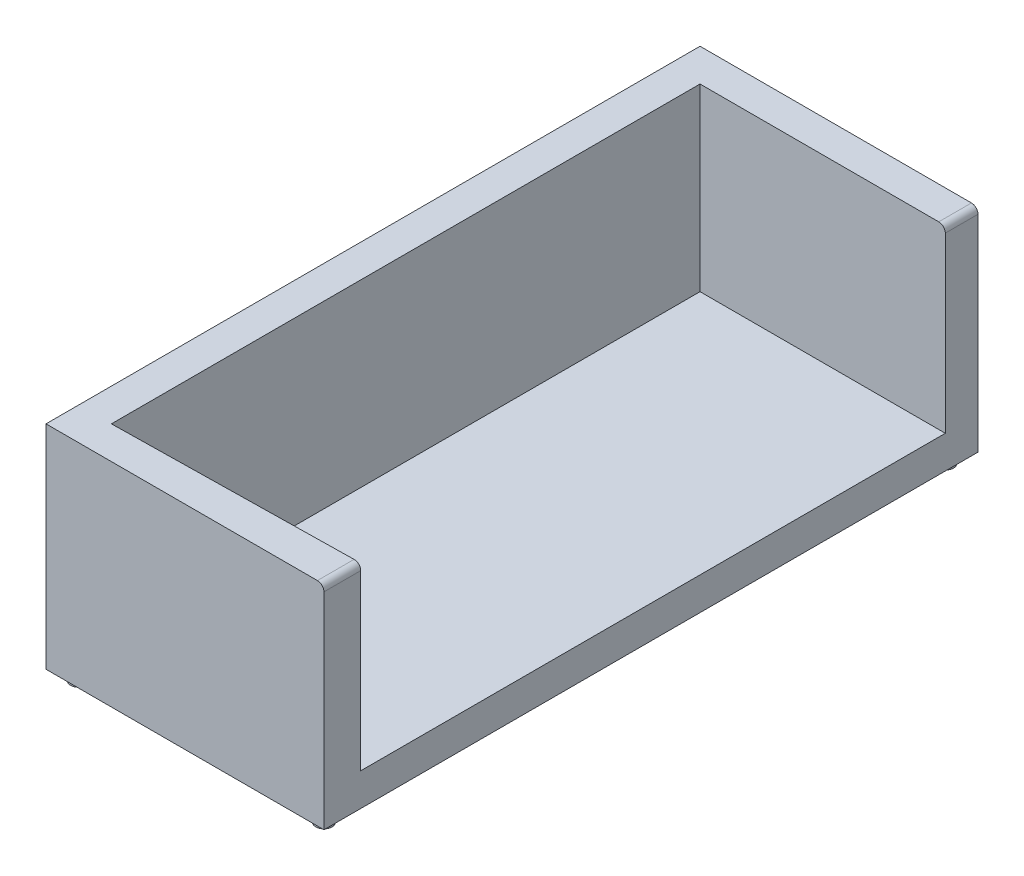
ISO-10303-21;
HEADER;
FILE_DESCRIPTION(('STEP AP214'),'2;1');
FILE_NAME('part.step','',(''),(''),'','','');
FILE_SCHEMA(('AUTOMOTIVE_DESIGN { 1 0 10303 214 1 1 1 1 }'));
ENDSEC;
DATA;
#1=APPLICATION_CONTEXT('core data for automotive mechanical design processes');
#2=APPLICATION_PROTOCOL_DEFINITION('international standard','automotive_design',2000,#1);
#3=PRODUCT_CONTEXT('',#1,'mechanical');
#4=PRODUCT('Part','Part','',(#3));
#5=PRODUCT_RELATED_PRODUCT_CATEGORY('part','',(#4));
#6=PRODUCT_DEFINITION_FORMATION('','',#4);
#7=PRODUCT_DEFINITION_CONTEXT('part definition',#1,'design');
#8=PRODUCT_DEFINITION('design','',#6,#7);
#9=PRODUCT_DEFINITION_SHAPE('','',#8);
#10=(LENGTH_UNIT() NAMED_UNIT(*) SI_UNIT(.MILLI.,.METRE.));
#11=(NAMED_UNIT(*) PLANE_ANGLE_UNIT() SI_UNIT($,.RADIAN.));
#12=(NAMED_UNIT(*) SI_UNIT($,.STERADIAN.) SOLID_ANGLE_UNIT());
#13=UNCERTAINTY_MEASURE_WITH_UNIT(LENGTH_MEASURE(1.E-05),#10,'distance_accuracy_value','');
#14=(GEOMETRIC_REPRESENTATION_CONTEXT(3) GLOBAL_UNCERTAINTY_ASSIGNED_CONTEXT((#13)) GLOBAL_UNIT_ASSIGNED_CONTEXT((#10,
#11,#12)) REPRESENTATION_CONTEXT('',''));
#15=CARTESIAN_POINT('',(0.,0.,0.));
#16=DIRECTION('',(0.,0.,1.));
#17=DIRECTION('',(1.,0.,0.));
#18=AXIS2_PLACEMENT_3D('',#15,#16,#17);
#19=CARTESIAN_POINT('',(405.,250.96506440014,2000.));
#20=DIRECTION('',(0.,0.,-1.));
#21=DIRECTION('',(-1.,0.,0.));
#22=AXIS2_PLACEMENT_3D('',#19,#20,#21);
#23=CYLINDRICAL_SURFACE('',#22,20.);
#24=DIRECTION('',(0.,0.,-1.));
#25=VECTOR('',#24,1.);
#26=CARTESIAN_POINT('',(405.,270.96506440014,2000.));
#27=LINE('',#26,#25);
#28=CARTESIAN_POINT('',(405.,270.96506440014,100.));
#29=VERTEX_POINT('',#28);
#30=CARTESIAN_POINT('',(405.,270.96506440014,0.));
#31=VERTEX_POINT('',#30);
#32=EDGE_CURVE('E121',#29,#31,#27,.T.);
#33=ORIENTED_EDGE('',*,*,#32,.F.);
#34=CARTESIAN_POINT('',(405.,250.96506440014,100.));
#35=DIRECTION('',(0.,0.,-1.));
#36=DIRECTION('',(-1.,0.,0.));
#37=AXIS2_PLACEMENT_3D('',#34,#35,#36);
#38=CIRCLE('',#37,20.);
#39=CARTESIAN_POINT('',(425.,250.96506440014,100.));
#40=VERTEX_POINT('',#39);
#41=EDGE_CURVE('E134',#29,#40,#38,.T.);
#42=ORIENTED_EDGE('',*,*,#41,.T.);
#43=DIRECTION('',(0.,0.,-1.));
#44=VECTOR('',#43,1.);
#45=CARTESIAN_POINT('',(425.,250.96506440014,2000.));
#46=LINE('',#45,#44);
#47=CARTESIAN_POINT('',(425.,250.96506440014,0.));
#48=VERTEX_POINT('',#47);
#49=EDGE_CURVE('E146',#40,#48,#46,.T.);
#50=ORIENTED_EDGE('',*,*,#49,.T.);
#51=CARTESIAN_POINT('',(405.,250.96506440014,0.));
#52=DIRECTION('',(0.,0.,1.));
#53=DIRECTION('',(-1.,0.,0.));
#54=AXIS2_PLACEMENT_3D('',#51,#52,#53);
#55=CIRCLE('',#54,20.);
#56=EDGE_CURVE('E133',#48,#31,#55,.T.);
#57=ORIENTED_EDGE('',*,*,#56,.T.);
#58=EDGE_LOOP('',(#33,#42,#50,#57));
#59=FACE_BOUND('',#58,.T.);
#60=ADVANCED_FACE('F42',(#59),#23,.T.);
#61=CARTESIAN_POINT('',(425.,250.96506440014,2000.));
#62=DIRECTION('',(-1.,0.,0.));
#63=DIRECTION('',(0.,0.,1.));
#64=AXIS2_PLACEMENT_3D('',#61,#62,#63);
#65=PLANE('',#64);
#66=ORIENTED_EDGE('',*,*,#49,.F.);
#67=DIRECTION('',(0.,1.,0.));
#68=VECTOR('',#67,1.);
#69=CARTESIAN_POINT('',(425.,-279.03493559986,100.));
#70=LINE('',#69,#68);
#71=CARTESIAN_POINT('',(425.,-279.03493559986,100.));
#72=VERTEX_POINT('',#71);
#73=EDGE_CURVE('E222',#72,#40,#70,.T.);
#74=ORIENTED_EDGE('',*,*,#73,.F.);
#75=DIRECTION('',(0.,0.,-1.));
#76=VECTOR('',#75,1.);
#77=CARTESIAN_POINT('',(425.,-279.03493559986,1887.57501564121));
#78=LINE('',#77,#76);
#79=CARTESIAN_POINT('',(425.,-279.03493559986,1887.57501564121));
#80=VERTEX_POINT('',#79);
#81=EDGE_CURVE('E218',#80,#72,#78,.T.);
#82=ORIENTED_EDGE('',*,*,#81,.F.);
#83=DIRECTION('',(0.,1.,0.));
#84=VECTOR('',#83,1.);
#85=CARTESIAN_POINT('',(425.,-279.03493559986,1887.57501564121));
#86=LINE('',#85,#84);
#87=CARTESIAN_POINT('',(425.,250.96506440014,1887.57501564121));
#88=VERTEX_POINT('',#87);
#89=EDGE_CURVE('E214',#80,#88,#86,.T.);
#90=ORIENTED_EDGE('',*,*,#89,.T.);
#91=CARTESIAN_POINT('',(425.,250.96506440014,2000.));
#92=VERTEX_POINT('',#91);
#93=EDGE_CURVE('E147',#92,#88,#46,.T.);
#94=ORIENTED_EDGE('',*,*,#93,.F.);
#95=DIRECTION('',(0.,1.,0.));
#96=VECTOR('',#95,1.);
#97=CARTESIAN_POINT('',(425.,250.96506440014,2000.));
#98=LINE('',#97,#96);
#99=CARTESIAN_POINT('',(425.,-379.03493559986,2000.));
#100=VERTEX_POINT('',#99);
#101=EDGE_CURVE('E141',#100,#92,#98,.T.);
#102=ORIENTED_EDGE('',*,*,#101,.F.);
#103=DIRECTION('',(0.,0.,-1.));
#104=VECTOR('',#103,1.);
#105=CARTESIAN_POINT('',(425.,-379.03493559986,2000.));
#106=LINE('',#105,#104);
#107=CARTESIAN_POINT('',(425.,-379.03493559986,0.));
#108=VERTEX_POINT('',#107);
#109=EDGE_CURVE('E126',#100,#108,#106,.T.);
#110=ORIENTED_EDGE('',*,*,#109,.T.);
#111=DIRECTION('',(0.,1.,0.));
#112=VECTOR('',#111,1.);
#113=CARTESIAN_POINT('',(425.,250.96506440014,0.));
#114=LINE('',#113,#112);
#115=EDGE_CURVE('E130',#108,#48,#114,.T.);
#116=ORIENTED_EDGE('',*,*,#115,.T.);
#117=EDGE_LOOP('',(#66,#74,#82,#90,#94,#102,#110,#116));
#118=FACE_BOUND('',#117,.T.);
#119=ADVANCED_FACE('F44',(#118),#65,.F.);
#120=ORIENTED_EDGE('',*,*,#93,.T.);
#121=CARTESIAN_POINT('',(405.,250.96506440014,1887.90634855744));
#122=DIRECTION('',(0.0165643728905062,0.,0.999862801363639));
#123=DIRECTION('',(0.999862801363639,0.,-0.0165643728905062));
#124=AXIS2_PLACEMENT_3D('',#121,#122,#123);
#125=ELLIPSE('',#124,20.0027443492482,20.);
#126=CARTESIAN_POINT('',(405.,270.96506440014,1887.90634855744));
#127=VERTEX_POINT('',#126);
#128=EDGE_CURVE('E206',#88,#127,#125,.T.);
#129=ORIENTED_EDGE('',*,*,#128,.T.);
#130=CARTESIAN_POINT('',(405.,270.96506440014,2000.));
#131=VERTEX_POINT('',#130);
#132=EDGE_CURVE('E144',#131,#127,#27,.T.);
#133=ORIENTED_EDGE('',*,*,#132,.F.);
#134=CARTESIAN_POINT('',(405.,250.96506440014,2000.));
#135=DIRECTION('',(0.,0.,1.));
#136=DIRECTION('',(-1.,0.,0.));
#137=AXIS2_PLACEMENT_3D('',#134,#135,#136);
#138=CIRCLE('',#137,20.);
#139=EDGE_CURVE('E99',#92,#131,#138,.T.);
#140=ORIENTED_EDGE('',*,*,#139,.F.);
#141=EDGE_LOOP('',(#120,#129,#133,#140));
#142=FACE_BOUND('',#141,.T.);
#143=ADVANCED_FACE('F190',(#142),#23,.T.);
#144=CARTESIAN_POINT('',(-425.,270.96506440014,2000.));
#145=DIRECTION('',(0.,-1.,0.));
#146=DIRECTION('',(0.,0.,-1.));
#147=AXIS2_PLACEMENT_3D('',#144,#145,#146);
#148=PLANE('',#147);
#149=DIRECTION('',(0.,0.,1.));
#150=VECTOR('',#149,1.);
#151=CARTESIAN_POINT('',(-325.,270.96506440014,100.));
#152=LINE('',#151,#150);
#153=CARTESIAN_POINT('',(-325.,270.96506440014,100.));
#154=VERTEX_POINT('',#153);
#155=CARTESIAN_POINT('',(-325.,270.96506440014,1900.));
#156=VERTEX_POINT('',#155);
#157=EDGE_CURVE('E57',#154,#156,#152,.T.);
#158=ORIENTED_EDGE('',*,*,#157,.F.);
#159=DIRECTION('',(1.,0.,0.));
#160=VECTOR('',#159,1.);
#161=CARTESIAN_POINT('',(-425.,270.96506440014,100.));
#162=LINE('',#161,#160);
#163=EDGE_CURVE('E149',#154,#29,#162,.T.);
#164=ORIENTED_EDGE('',*,*,#163,.T.);
#165=ORIENTED_EDGE('',*,*,#32,.T.);
#166=DIRECTION('',(-1.,0.,0.));
#167=VECTOR('',#166,1.);
#168=CARTESIAN_POINT('',(-425.,270.96506440014,0.));
#169=LINE('',#168,#167);
#170=CARTESIAN_POINT('',(-425.,270.96506440014,0.));
#171=VERTEX_POINT('',#170);
#172=EDGE_CURVE('E118',#31,#171,#169,.T.);
#173=ORIENTED_EDGE('',*,*,#172,.T.);
#174=DIRECTION('',(0.,0.,-1.));
#175=VECTOR('',#174,1.);
#176=CARTESIAN_POINT('',(-425.,270.96506440014,2000.));
#177=LINE('',#176,#175);
#178=CARTESIAN_POINT('',(-425.,270.96506440014,2000.));
#179=VERTEX_POINT('',#178);
#180=EDGE_CURVE('E115',#179,#171,#177,.T.);
#181=ORIENTED_EDGE('',*,*,#180,.F.);
#182=DIRECTION('',(-1.,0.,0.));
#183=VECTOR('',#182,1.);
#184=CARTESIAN_POINT('',(-425.,270.96506440014,2000.));
#185=LINE('',#184,#183);
#186=EDGE_CURVE('E105',#131,#179,#185,.T.);
#187=ORIENTED_EDGE('',*,*,#186,.F.);
#188=ORIENTED_EDGE('',*,*,#132,.T.);
#189=DIRECTION('',(0.999862801363639,0.,-0.0165643728905062));
#190=VECTOR('',#189,1.);
#191=CARTESIAN_POINT('',(-325.,270.96506440014,1900.));
#192=LINE('',#191,#190);
#193=EDGE_CURVE('E433',#156,#127,#192,.T.);
#194=ORIENTED_EDGE('',*,*,#193,.F.);
#195=EDGE_LOOP('',(#158,#164,#165,#173,#181,#187,#188,#194));
#196=FACE_BOUND('',#195,.T.);
#197=ADVANCED_FACE('F116',(#196),#148,.F.);
#198=CARTESIAN_POINT('',(-425.,270.96506440014,2000.));
#199=DIRECTION('',(1.,0.,0.));
#200=DIRECTION('',(0.,0.,-1.));
#201=AXIS2_PLACEMENT_3D('',#198,#199,#200);
#202=PLANE('',#201);
#203=DIRECTION('',(0.,-1.,0.));
#204=VECTOR('',#203,1.);
#205=CARTESIAN_POINT('',(-425.,270.96506440014,0.));
#206=LINE('',#205,#204);
#207=CARTESIAN_POINT('',(-425.,-379.03493559986,0.));
#208=VERTEX_POINT('',#207);
#209=EDGE_CURVE('E138',#171,#208,#206,.T.);
#210=ORIENTED_EDGE('',*,*,#209,.T.);
#211=DIRECTION('',(0.,0.,-1.));
#212=VECTOR('',#211,1.);
#213=CARTESIAN_POINT('',(-425.,-379.03493559986,2000.));
#214=LINE('',#213,#212);
#215=CARTESIAN_POINT('',(-425.,-379.03493559986,2000.));
#216=VERTEX_POINT('',#215);
#217=EDGE_CURVE('E122',#216,#208,#214,.T.);
#218=ORIENTED_EDGE('',*,*,#217,.F.);
#219=DIRECTION('',(0.,-1.,0.));
#220=VECTOR('',#219,1.);
#221=CARTESIAN_POINT('',(-425.,270.96506440014,2000.));
#222=LINE('',#221,#220);
#223=EDGE_CURVE('E109',#179,#216,#222,.T.);
#224=ORIENTED_EDGE('',*,*,#223,.F.);
#225=ORIENTED_EDGE('',*,*,#180,.T.);
#226=EDGE_LOOP('',(#210,#218,#224,#225));
#227=FACE_BOUND('',#226,.T.);
#228=ADVANCED_FACE('F124',(#227),#202,.F.);
#229=CARTESIAN_POINT('',(-425.,-379.03493559986,2000.));
#230=DIRECTION('',(0.,1.,0.));
#231=DIRECTION('',(0.,0.,1.));
#232=AXIS2_PLACEMENT_3D('',#229,#230,#231);
#233=PLANE('',#232);
#234=CARTESIAN_POINT('',(375.,-379.03493559986,50.));
#235=DIRECTION('',(0.,1.,0.));
#236=DIRECTION('',(0.,0.,1.));
#237=AXIS2_PLACEMENT_3D('',#234,#235,#236);
#238=CIRCLE('',#237,25.);
#239=CARTESIAN_POINT('',(375.,-379.03493559986,75.));
#240=VERTEX_POINT('',#239);
#241=EDGE_CURVE('E11',#240,#240,#238,.F.);
#242=ORIENTED_EDGE('',*,*,#241,.F.);
#243=EDGE_LOOP('',(#242));
#244=FACE_BOUND('',#243,.T.);
#245=CARTESIAN_POINT('',(-375.,-379.03493559986,50.));
#246=DIRECTION('',(0.,1.,0.));
#247=DIRECTION('',(0.,0.,1.));
#248=AXIS2_PLACEMENT_3D('',#245,#246,#247);
#249=CIRCLE('',#248,25.);
#250=CARTESIAN_POINT('',(-375.,-379.03493559986,75.));
#251=VERTEX_POINT('',#250);
#252=EDGE_CURVE('E50',#251,#251,#249,.F.);
#253=ORIENTED_EDGE('',*,*,#252,.F.);
#254=EDGE_LOOP('',(#253));
#255=FACE_BOUND('',#254,.T.);
#256=CARTESIAN_POINT('',(375.,-379.03493559986,1950.));
#257=DIRECTION('',(0.,1.,0.));
#258=DIRECTION('',(0.,0.,1.));
#259=AXIS2_PLACEMENT_3D('',#256,#257,#258);
#260=CIRCLE('',#259,25.);
#261=CARTESIAN_POINT('',(375.,-379.03493559986,1975.));
#262=VERTEX_POINT('',#261);
#263=EDGE_CURVE('E155',#262,#262,#260,.F.);
#264=ORIENTED_EDGE('',*,*,#263,.F.);
#265=EDGE_LOOP('',(#264));
#266=FACE_BOUND('',#265,.T.);
#267=CARTESIAN_POINT('',(-375.,-379.03493559986,1950.));
#268=DIRECTION('',(0.,1.,0.));
#269=DIRECTION('',(0.,0.,1.));
#270=AXIS2_PLACEMENT_3D('',#267,#268,#269);
#271=CIRCLE('',#270,25.);
#272=CARTESIAN_POINT('',(-375.,-379.03493559986,1975.));
#273=VERTEX_POINT('',#272);
#274=EDGE_CURVE('E152',#273,#273,#271,.F.);
#275=ORIENTED_EDGE('',*,*,#274,.F.);
#276=EDGE_LOOP('',(#275));
#277=FACE_BOUND('',#276,.T.);
#278=DIRECTION('',(1.,0.,0.));
#279=VECTOR('',#278,1.);
#280=CARTESIAN_POINT('',(-425.,-379.03493559986,0.));
#281=LINE('',#280,#279);
#282=EDGE_CURVE('E90',#208,#108,#281,.T.);
#283=ORIENTED_EDGE('',*,*,#282,.T.);
#284=ORIENTED_EDGE('',*,*,#109,.F.);
#285=DIRECTION('',(1.,0.,0.));
#286=VECTOR('',#285,1.);
#287=CARTESIAN_POINT('',(-425.,-379.03493559986,2000.));
#288=LINE('',#287,#286);
#289=EDGE_CURVE('E66',#216,#100,#288,.T.);
#290=ORIENTED_EDGE('',*,*,#289,.F.);
#291=ORIENTED_EDGE('',*,*,#217,.T.);
#292=EDGE_LOOP('',(#283,#284,#290,#291));
#293=FACE_BOUND('',#292,.T.);
#294=ADVANCED_FACE('F162',(#244,#255,#266,#277,#293),#233,.F.);
#295=CARTESIAN_POINT('',(405.,250.96506440014,2000.));
#296=DIRECTION('',(0.,0.,-1.));
#297=DIRECTION('',(-1.,0.,0.));
#298=AXIS2_PLACEMENT_3D('',#295,#296,#297);
#299=PLANE('',#298);
#300=ORIENTED_EDGE('',*,*,#101,.T.);
#301=ORIENTED_EDGE('',*,*,#139,.T.);
#302=ORIENTED_EDGE('',*,*,#186,.T.);
#303=ORIENTED_EDGE('',*,*,#223,.T.);
#304=ORIENTED_EDGE('',*,*,#289,.T.);
#305=EDGE_LOOP('',(#300,#301,#302,#303,#304));
#306=FACE_BOUND('',#305,.T.);
#307=ADVANCED_FACE('F107',(#306),#299,.F.);
#308=CARTESIAN_POINT('',(405.,250.96506440014,0.));
#309=DIRECTION('',(0.,0.,-1.));
#310=DIRECTION('',(-1.,0.,0.));
#311=AXIS2_PLACEMENT_3D('',#308,#309,#310);
#312=PLANE('',#311);
#313=ORIENTED_EDGE('',*,*,#115,.F.);
#314=ORIENTED_EDGE('',*,*,#282,.F.);
#315=ORIENTED_EDGE('',*,*,#209,.F.);
#316=ORIENTED_EDGE('',*,*,#172,.F.);
#317=ORIENTED_EDGE('',*,*,#56,.F.);
#318=EDGE_LOOP('',(#313,#314,#315,#316,#317));
#319=FACE_BOUND('',#318,.T.);
#320=ADVANCED_FACE('F242',(#319),#312,.T.);
#321=CARTESIAN_POINT('',(-325.,-279.03493559986,100.));
#322=DIRECTION('',(0.,0.,-1.));
#323=DIRECTION('',(-1.,0.,0.));
#324=AXIS2_PLACEMENT_3D('',#321,#322,#323);
#325=PLANE('',#324);
#326=ORIENTED_EDGE('',*,*,#163,.F.);
#327=DIRECTION('',(0.,1.,0.));
#328=VECTOR('',#327,1.);
#329=CARTESIAN_POINT('',(-325.,-279.03493559986,100.));
#330=LINE('',#329,#328);
#331=CARTESIAN_POINT('',(-325.,-279.03493559986,100.));
#332=VERTEX_POINT('',#331);
#333=EDGE_CURVE('E226',#332,#154,#330,.T.);
#334=ORIENTED_EDGE('',*,*,#333,.F.);
#335=DIRECTION('',(-1.,0.,0.));
#336=VECTOR('',#335,1.);
#337=CARTESIAN_POINT('',(-325.,-279.03493559986,100.));
#338=LINE('',#337,#336);
#339=EDGE_CURVE('E228',#72,#332,#338,.T.);
#340=ORIENTED_EDGE('',*,*,#339,.F.);
#341=ORIENTED_EDGE('',*,*,#73,.T.);
#342=ORIENTED_EDGE('',*,*,#41,.F.);
#343=EDGE_LOOP('',(#326,#334,#340,#341,#342));
#344=FACE_BOUND('',#343,.T.);
#345=ADVANCED_FACE('F244',(#344),#325,.F.);
#346=CARTESIAN_POINT('',(-325.,-279.03493559986,1900.));
#347=DIRECTION('',(0.0165643728905062,0.,0.999862801363639));
#348=DIRECTION('',(0.999862801363639,0.,-0.0165643728905062));
#349=AXIS2_PLACEMENT_3D('',#346,#347,#348);
#350=PLANE('',#349);
#351=ORIENTED_EDGE('',*,*,#89,.F.);
#352=DIRECTION('',(0.999862801363639,0.,-0.0165643728905062));
#353=VECTOR('',#352,1.);
#354=CARTESIAN_POINT('',(-325.,-279.03493559986,1900.));
#355=LINE('',#354,#353);
#356=CARTESIAN_POINT('',(-325.,-279.03493559986,1900.));
#357=VERTEX_POINT('',#356);
#358=EDGE_CURVE('E432',#357,#80,#355,.T.);
#359=ORIENTED_EDGE('',*,*,#358,.F.);
#360=DIRECTION('',(0.,1.,0.));
#361=VECTOR('',#360,1.);
#362=CARTESIAN_POINT('',(-325.,-279.03493559986,1900.));
#363=LINE('',#362,#361);
#364=EDGE_CURVE('E223',#357,#156,#363,.T.);
#365=ORIENTED_EDGE('',*,*,#364,.T.);
#366=ORIENTED_EDGE('',*,*,#193,.T.);
#367=ORIENTED_EDGE('',*,*,#128,.F.);
#368=EDGE_LOOP('',(#351,#359,#365,#366,#367));
#369=FACE_BOUND('',#368,.T.);
#370=ADVANCED_FACE('F250',(#369),#350,.F.);
#371=CARTESIAN_POINT('',(-325.,-279.03493559986,100.));
#372=DIRECTION('',(-1.,0.,0.));
#373=DIRECTION('',(0.,0.,1.));
#374=AXIS2_PLACEMENT_3D('',#371,#372,#373);
#375=PLANE('',#374);
#376=ORIENTED_EDGE('',*,*,#157,.T.);
#377=ORIENTED_EDGE('',*,*,#364,.F.);
#378=DIRECTION('',(0.,0.,1.));
#379=VECTOR('',#378,1.);
#380=CARTESIAN_POINT('',(-325.,-279.03493559986,100.));
#381=LINE('',#380,#379);
#382=EDGE_CURVE('E429',#332,#357,#381,.T.);
#383=ORIENTED_EDGE('',*,*,#382,.F.);
#384=ORIENTED_EDGE('',*,*,#333,.T.);
#385=EDGE_LOOP('',(#376,#377,#383,#384));
#386=FACE_BOUND('',#385,.T.);
#387=ADVANCED_FACE('F184',(#386),#375,.F.);
#388=CARTESIAN_POINT('',(0.,-279.03493559986,0.));
#389=DIRECTION('',(0.,1.,0.));
#390=DIRECTION('',(0.,0.,1.));
#391=AXIS2_PLACEMENT_3D('',#388,#389,#390);
#392=PLANE('',#391);
#393=ORIENTED_EDGE('',*,*,#382,.T.);
#394=ORIENTED_EDGE('',*,*,#358,.T.);
#395=ORIENTED_EDGE('',*,*,#81,.T.);
#396=ORIENTED_EDGE('',*,*,#339,.T.);
#397=EDGE_LOOP('',(#393,#394,#395,#396));
#398=FACE_BOUND('',#397,.T.);
#399=ADVANCED_FACE('F174',(#398),#392,.T.);
#400=CARTESIAN_POINT('',(-375.,-409.03493559986,1950.));
#401=DIRECTION('',(0.,1.,0.));
#402=DIRECTION('',(0.,0.,1.));
#403=AXIS2_PLACEMENT_3D('',#400,#401,#402);
#404=CYLINDRICAL_SURFACE('',#403,25.);
#405=CARTESIAN_POINT('',(-375.,-409.03493559986,1950.));
#406=DIRECTION('',(0.,-1.,0.));
#407=DIRECTION('',(0.,0.,-1.));
#408=AXIS2_PLACEMENT_3D('',#405,#406,#407);
#409=CIRCLE('',#408,25.);
#410=CARTESIAN_POINT('',(-375.,-409.03493559986,1925.));
#411=VERTEX_POINT('',#410);
#412=EDGE_CURVE('E426',#411,#411,#409,.T.);
#413=ORIENTED_EDGE('',*,*,#412,.F.);
#414=EDGE_LOOP('',(#413));
#415=FACE_BOUND('',#414,.T.);
#416=ORIENTED_EDGE('',*,*,#274,.T.);
#417=EDGE_LOOP('',(#416));
#418=FACE_BOUND('',#417,.T.);
#419=ADVANCED_FACE('F171',(#415,#418),#404,.T.);
#420=CARTESIAN_POINT('',(-375.,-409.03493559986,1950.));
#421=DIRECTION('',(0.,-1.,0.));
#422=DIRECTION('',(0.,0.,-1.));
#423=AXIS2_PLACEMENT_3D('',#420,#421,#422);
#424=PLANE('',#423);
#425=ORIENTED_EDGE('',*,*,#412,.T.);
#426=EDGE_LOOP('',(#425));
#427=FACE_BOUND('',#426,.T.);
#428=ADVANCED_FACE('F173',(#427),#424,.T.);
#429=CARTESIAN_POINT('',(375.,-409.03493559986,1950.));
#430=DIRECTION('',(0.,1.,0.));
#431=DIRECTION('',(0.,0.,1.));
#432=AXIS2_PLACEMENT_3D('',#429,#430,#431);
#433=CYLINDRICAL_SURFACE('',#432,25.);
#434=CARTESIAN_POINT('',(375.,-409.03493559986,1950.));
#435=DIRECTION('',(0.,-1.,0.));
#436=DIRECTION('',(0.,0.,-1.));
#437=AXIS2_PLACEMENT_3D('',#434,#435,#436);
#438=CIRCLE('',#437,25.);
#439=CARTESIAN_POINT('',(375.,-409.03493559986,1925.));
#440=VERTEX_POINT('',#439);
#441=EDGE_CURVE('E421',#440,#440,#438,.T.);
#442=ORIENTED_EDGE('',*,*,#441,.F.);
#443=EDGE_LOOP('',(#442));
#444=FACE_BOUND('',#443,.T.);
#445=ORIENTED_EDGE('',*,*,#263,.T.);
#446=EDGE_LOOP('',(#445));
#447=FACE_BOUND('',#446,.T.);
#448=ADVANCED_FACE('F181',(#444,#447),#433,.T.);
#449=CARTESIAN_POINT('',(375.,-409.03493559986,1950.));
#450=DIRECTION('',(0.,-1.,0.));
#451=DIRECTION('',(0.,0.,-1.));
#452=AXIS2_PLACEMENT_3D('',#449,#450,#451);
#453=PLANE('',#452);
#454=ORIENTED_EDGE('',*,*,#441,.T.);
#455=EDGE_LOOP('',(#454));
#456=FACE_BOUND('',#455,.T.);
#457=ADVANCED_FACE('F351',(#456),#453,.T.);
#458=CARTESIAN_POINT('',(-375.,-409.03493559986,50.));
#459=DIRECTION('',(0.,1.,0.));
#460=DIRECTION('',(0.,0.,1.));
#461=AXIS2_PLACEMENT_3D('',#458,#459,#460);
#462=CYLINDRICAL_SURFACE('',#461,25.);
#463=CARTESIAN_POINT('',(-375.,-409.03493559986,50.));
#464=DIRECTION('',(0.,-1.,0.));
#465=DIRECTION('',(0.,0.,-1.));
#466=AXIS2_PLACEMENT_3D('',#463,#464,#465);
#467=CIRCLE('',#466,25.);
#468=CARTESIAN_POINT('',(-375.,-409.03493559986,25.));
#469=VERTEX_POINT('',#468);
#470=EDGE_CURVE('E418',#469,#469,#467,.T.);
#471=ORIENTED_EDGE('',*,*,#470,.F.);
#472=EDGE_LOOP('',(#471));
#473=FACE_BOUND('',#472,.T.);
#474=ORIENTED_EDGE('',*,*,#252,.T.);
#475=EDGE_LOOP('',(#474));
#476=FACE_BOUND('',#475,.T.);
#477=ADVANCED_FACE('F160',(#473,#476),#462,.T.);
#478=CARTESIAN_POINT('',(-375.,-409.03493559986,50.));
#479=DIRECTION('',(0.,-1.,0.));
#480=DIRECTION('',(0.,0.,-1.));
#481=AXIS2_PLACEMENT_3D('',#478,#479,#480);
#482=PLANE('',#481);
#483=ORIENTED_EDGE('',*,*,#470,.T.);
#484=EDGE_LOOP('',(#483));
#485=FACE_BOUND('',#484,.T.);
#486=ADVANCED_FACE('F372',(#485),#482,.T.);
#487=CARTESIAN_POINT('',(375.,-409.03493559986,50.));
#488=DIRECTION('',(0.,1.,0.));
#489=DIRECTION('',(0.,0.,1.));
#490=AXIS2_PLACEMENT_3D('',#487,#488,#489);
#491=CYLINDRICAL_SURFACE('',#490,25.);
#492=CARTESIAN_POINT('',(375.,-409.03493559986,50.));
#493=DIRECTION('',(0.,-1.,0.));
#494=DIRECTION('',(0.,0.,-1.));
#495=AXIS2_PLACEMENT_3D('',#492,#493,#494);
#496=CIRCLE('',#495,25.);
#497=CARTESIAN_POINT('',(375.,-409.03493559986,25.));
#498=VERTEX_POINT('',#497);
#499=EDGE_CURVE('E417',#498,#498,#496,.T.);
#500=ORIENTED_EDGE('',*,*,#499,.F.);
#501=EDGE_LOOP('',(#500));
#502=FACE_BOUND('',#501,.T.);
#503=ORIENTED_EDGE('',*,*,#241,.T.);
#504=EDGE_LOOP('',(#503));
#505=FACE_BOUND('',#504,.T.);
#506=ADVANCED_FACE('F383',(#502,#505),#491,.T.);
#507=CARTESIAN_POINT('',(375.,-409.03493559986,50.));
#508=DIRECTION('',(0.,-1.,0.));
#509=DIRECTION('',(0.,0.,-1.));
#510=AXIS2_PLACEMENT_3D('',#507,#508,#509);
#511=PLANE('',#510);
#512=ORIENTED_EDGE('',*,*,#499,.T.);
#513=EDGE_LOOP('',(#512));
#514=FACE_BOUND('',#513,.T.);
#515=ADVANCED_FACE('F394',(#514),#511,.T.);
#516=CLOSED_SHELL('',(#60,#119,#143,#197,#228,#294,#307,#320,#345,#370,#387,#399,#419,#428,#448,
#457,#477,#486,#506,#515));
#517=MANIFOLD_SOLID_BREP('B2',#516);
#518=ADVANCED_BREP_SHAPE_REPRESENTATION('',(#18,#517),#14);
#519=SHAPE_DEFINITION_REPRESENTATION(#9,#518);
ENDSEC;
END-ISO-10303-21;
